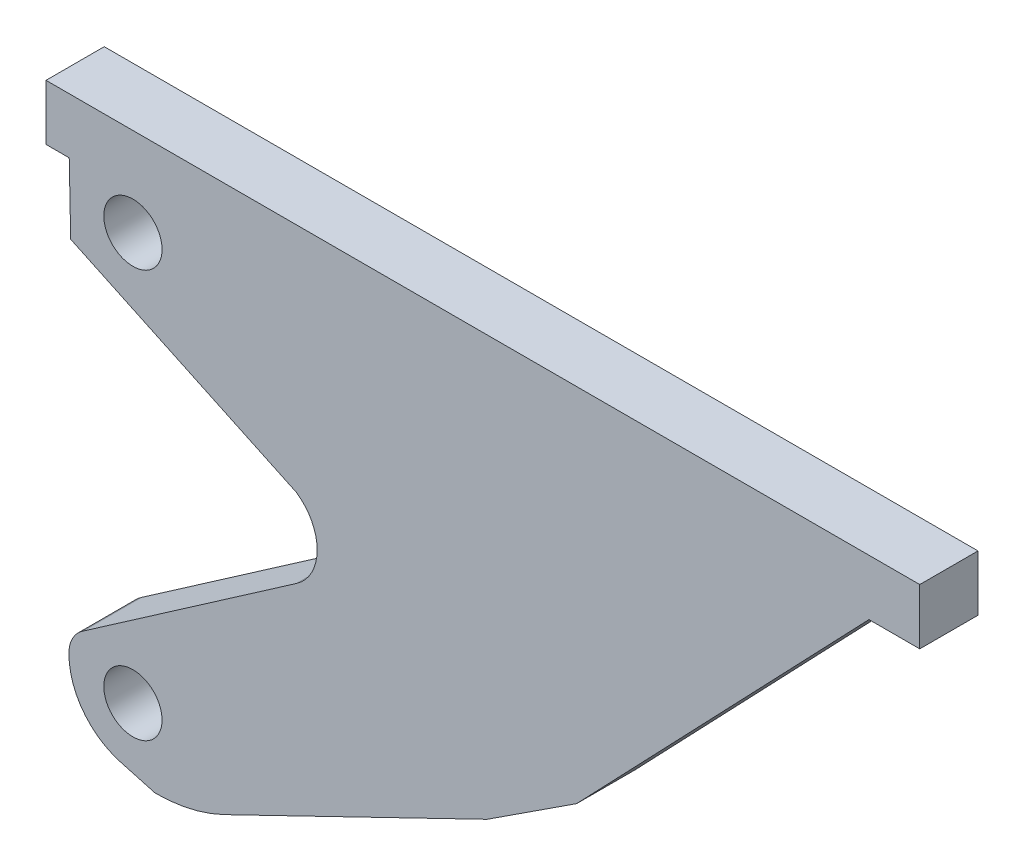
ISO-10303-21;
HEADER;
FILE_DESCRIPTION(('STEP AP214'),'2;1');
FILE_NAME('part.step','',(''),(''),'','','');
FILE_SCHEMA(('AUTOMOTIVE_DESIGN { 1 0 10303 214 1 1 1 1 }'));
ENDSEC;
DATA;
#1=APPLICATION_CONTEXT('core data for automotive mechanical design processes');
#2=APPLICATION_PROTOCOL_DEFINITION('international standard','automotive_design',2000,#1);
#3=PRODUCT_CONTEXT('',#1,'mechanical');
#4=PRODUCT('Part','Part','',(#3));
#5=PRODUCT_RELATED_PRODUCT_CATEGORY('part','',(#4));
#6=PRODUCT_DEFINITION_FORMATION('','',#4);
#7=PRODUCT_DEFINITION_CONTEXT('part definition',#1,'design');
#8=PRODUCT_DEFINITION('design','',#6,#7);
#9=PRODUCT_DEFINITION_SHAPE('','',#8);
#10=(LENGTH_UNIT() NAMED_UNIT(*) SI_UNIT(.MILLI.,.METRE.));
#11=(NAMED_UNIT(*) PLANE_ANGLE_UNIT() SI_UNIT($,.RADIAN.));
#12=(NAMED_UNIT(*) SI_UNIT($,.STERADIAN.) SOLID_ANGLE_UNIT());
#13=UNCERTAINTY_MEASURE_WITH_UNIT(LENGTH_MEASURE(1.E-05),#10,'distance_accuracy_value','');
#14=(GEOMETRIC_REPRESENTATION_CONTEXT(3) GLOBAL_UNCERTAINTY_ASSIGNED_CONTEXT((#13)) GLOBAL_UNIT_ASSIGNED_CONTEXT((#10,
#11,#12)) REPRESENTATION_CONTEXT('',''));
#15=CARTESIAN_POINT('',(0.,0.,0.));
#16=DIRECTION('',(0.,0.,1.));
#17=DIRECTION('',(1.,0.,0.));
#18=AXIS2_PLACEMENT_3D('',#15,#16,#17);
#19=CARTESIAN_POINT('',(18.5660887042144,33.5697337801908,20.));
#20=DIRECTION('',(0.,0.,-1.));
#21=DIRECTION('',(-1.,0.,0.));
#22=AXIS2_PLACEMENT_3D('',#19,#20,#21);
#23=PLANE('',#22);
#24=CARTESIAN_POINT('',(18.5660887042144,33.5697337801908,20.));
#25=DIRECTION('',(0.,0.,1.));
#26=DIRECTION('',(-1.,0.,0.));
#27=AXIS2_PLACEMENT_3D('',#24,#25,#26);
#28=CIRCLE('',#27,10.6872798444424);
#29=CARTESIAN_POINT('',(12.678109290342,42.4887947674943,20.));
#30=VERTEX_POINT('',#29);
#31=CARTESIAN_POINT('',(7.88121750242458,33.7966211412047,20.));
#32=VERTEX_POINT('',#31);
#33=EDGE_CURVE('E242',#30,#32,#28,.T.);
#34=ORIENTED_EDGE('',*,*,#33,.T.);
#35=CARTESIAN_POINT('',(32.0141573052579,33.2841714427511,20.));
#36=DIRECTION('',(0.,0.,1.));
#37=DIRECTION('',(-1.,0.,0.));
#38=AXIS2_PLACEMENT_3D('',#35,#36,#37);
#39=CIRCLE('',#38,24.1383799833506);
#40=CARTESIAN_POINT('',(25.5748035964629,10.0205493680688,20.));
#41=VERTEX_POINT('',#40);
#42=EDGE_CURVE('E129',#32,#41,#39,.T.);
#43=ORIENTED_EDGE('',*,*,#42,.T.);
#44=DIRECTION('',(0.963760703523948,-0.266768263372957,0.));
#45=VECTOR('',#44,1.);
#46=CARTESIAN_POINT('',(37.4689225243492,6.72826587991469,20.));
#47=LINE('',#46,#45);
#48=CARTESIAN_POINT('',(37.4689225243492,6.72826587991469,20.));
#49=VERTEX_POINT('',#48);
#50=EDGE_CURVE('E295',#41,#49,#47,.T.);
#51=ORIENTED_EDGE('',*,*,#50,.T.);
#52=CARTESIAN_POINT('',(37.4689225243491,61.078050884108,20.));
#53=DIRECTION('',(0.,0.,1.));
#54=DIRECTION('',(-1.,0.,0.));
#55=AXIS2_PLACEMENT_3D('',#52,#53,#54);
#56=CIRCLE('',#55,54.3497850041933);
#57=CARTESIAN_POINT('',(61.1680774455038,12.1674264143147,20.));
#58=VERTEX_POINT('',#57);
#59=EDGE_CURVE('E315',#49,#58,#56,.T.);
#60=ORIENTED_EDGE('',*,*,#59,.T.);
#61=DIRECTION('',(0.899923053348227,0.43604873357505,0.));
#62=VECTOR('',#61,1.);
#63=CARTESIAN_POINT('',(151.43934620471,55.9074687148351,20.));
#64=LINE('',#63,#62);
#65=CARTESIAN_POINT('',(151.43934620471,55.9074687148351,20.));
#66=VERTEX_POINT('',#65);
#67=EDGE_CURVE('E311',#58,#66,#64,.T.);
#68=ORIENTED_EDGE('',*,*,#67,.T.);
#69=DIRECTION('',(0.837867904245027,0.545873039301307,0.));
#70=VECTOR('',#69,1.);
#71=CARTESIAN_POINT('',(182.18007939204,75.9351334222431,20.));
#72=LINE('',#71,#70);
#73=CARTESIAN_POINT('',(182.18007939204,75.9351334222431,20.));
#74=VERTEX_POINT('',#73);
#75=EDGE_CURVE('E314',#66,#74,#72,.T.);
#76=ORIENTED_EDGE('',*,*,#75,.T.);
#77=DIRECTION('',(0.691287277727629,0.722580029928813,0.));
#78=VECTOR('',#77,1.);
#79=CARTESIAN_POINT('',(282.564213808547,180.863392899973,20.));
#80=LINE('',#79,#78);
#81=CARTESIAN_POINT('',(282.564213808547,180.863392899973,20.));
#82=VERTEX_POINT('',#81);
#83=EDGE_CURVE('E319',#74,#82,#80,.T.);
#84=ORIENTED_EDGE('',*,*,#83,.T.);
#85=DIRECTION('',(1.,0.,0.));
#86=VECTOR('',#85,1.);
#87=CARTESIAN_POINT('',(300.,180.863392899973,20.));
#88=LINE('',#87,#86);
#89=CARTESIAN_POINT('',(300.,180.863392899973,20.));
#90=VERTEX_POINT('',#89);
#91=EDGE_CURVE('E327',#82,#90,#88,.T.);
#92=ORIENTED_EDGE('',*,*,#91,.T.);
#93=DIRECTION('',(0.,1.,0.));
#94=VECTOR('',#93,1.);
#95=CARTESIAN_POINT('',(300.,200.,20.));
#96=LINE('',#95,#94);
#97=CARTESIAN_POINT('',(300.,200.,20.));
#98=VERTEX_POINT('',#97);
#99=EDGE_CURVE('E330',#90,#98,#96,.T.);
#100=ORIENTED_EDGE('',*,*,#99,.T.);
#101=DIRECTION('',(-0.99999997295116,-0.000232589076362976,0.));
#102=VECTOR('',#101,1.);
#103=CARTESIAN_POINT('',(0.,199.930223275204,20.));
#104=LINE('',#103,#102);
#105=CARTESIAN_POINT('',(0.,199.930223275204,20.));
#106=VERTEX_POINT('',#105);
#107=EDGE_CURVE('E332',#98,#106,#104,.T.);
#108=ORIENTED_EDGE('',*,*,#107,.T.);
#109=DIRECTION('',(0.,-1.,0.));
#110=VECTOR('',#109,1.);
#111=CARTESIAN_POINT('',(0.,180.863392899973,20.));
#112=LINE('',#111,#110);
#113=CARTESIAN_POINT('',(0.,180.863392899973,20.));
#114=VERTEX_POINT('',#113);
#115=EDGE_CURVE('E336',#106,#114,#112,.T.);
#116=ORIENTED_EDGE('',*,*,#115,.T.);
#117=DIRECTION('',(1.,0.,0.));
#118=VECTOR('',#117,1.);
#119=CARTESIAN_POINT('',(7.97663603526422,180.863392899973,20.));
#120=LINE('',#119,#118);
#121=CARTESIAN_POINT('',(7.97663603526422,180.863392899973,20.));
#122=VERTEX_POINT('',#121);
#123=EDGE_CURVE('E339',#114,#122,#120,.T.);
#124=ORIENTED_EDGE('',*,*,#123,.T.);
#125=DIRECTION('',(0.0210436934428124,-0.999778556964633,0.));
#126=VECTOR('',#125,1.);
#127=CARTESIAN_POINT('',(8.48105642891595,156.89855542317,20.));
#128=LINE('',#127,#126);
#129=CARTESIAN_POINT('',(8.48105642891595,156.89855542317,20.));
#130=VERTEX_POINT('',#129);
#131=EDGE_CURVE('E172',#122,#130,#128,.T.);
#132=ORIENTED_EDGE('',*,*,#131,.T.);
#133=DIRECTION('',(0.904610586069068,-0.426239002874887,0.));
#134=VECTOR('',#133,1.);
#135=CARTESIAN_POINT('',(86.0364227386809,120.35562467203,20.));
#136=LINE('',#135,#134);
#137=CARTESIAN_POINT('',(86.0364227386809,120.35562467203,20.));
#138=VERTEX_POINT('',#137);
#139=EDGE_CURVE('E166',#130,#138,#136,.T.);
#140=ORIENTED_EDGE('',*,*,#139,.T.);
#141=CARTESIAN_POINT('',(76.6736149660051,106.849857246686,20.));
#142=DIRECTION('',(0.,0.,-1.));
#143=DIRECTION('',(1.,0.,0.));
#144=AXIS2_PLACEMENT_3D('',#141,#142,#143);
#145=CIRCLE('',#144,16.4337434303797);
#146=CARTESIAN_POINT('',(86.0364227386809,93.3440898213426,20.));
#147=VERTEX_POINT('',#146);
#148=EDGE_CURVE('E170',#138,#147,#145,.T.);
#149=ORIENTED_EDGE('',*,*,#148,.T.);
#150=DIRECTION('',(-0.821831464179762,-0.569730677148553,0.));
#151=VECTOR('',#150,1.);
#152=CARTESIAN_POINT('',(12.678109290342,42.4887947674943,20.));
#153=LINE('',#152,#151);
#154=EDGE_CURVE('E62',#147,#30,#153,.T.);
#155=ORIENTED_EDGE('',*,*,#154,.T.);
#156=EDGE_LOOP('',(#34,#43,#51,#60,#68,#76,#84,#92,#100,#108,#116,#124,#132,#140,#149,#155));
#157=FACE_BOUND('',#156,.T.);
#158=CARTESIAN_POINT('',(29.8456107963056,29.6227737011177,20.));
#159=DIRECTION('',(0.,0.,1.));
#160=DIRECTION('',(1.,0.,0.));
#161=AXIS2_PLACEMENT_3D('',#158,#159,#160);
#162=CIRCLE('',#161,10.);
#163=CARTESIAN_POINT('',(39.8456107963056,29.6227737011177,20.));
#164=VERTEX_POINT('',#163);
#165=EDGE_CURVE('E200',#164,#164,#162,.T.);
#166=ORIENTED_EDGE('',*,*,#165,.F.);
#167=EDGE_LOOP('',(#166));
#168=FACE_BOUND('',#167,.T.);
#169=CARTESIAN_POINT('',(29.8456107963056,169.541616803424,20.));
#170=DIRECTION('',(0.,0.,1.));
#171=DIRECTION('',(1.,0.,0.));
#172=AXIS2_PLACEMENT_3D('',#169,#170,#171);
#173=CIRCLE('',#172,10.);
#174=CARTESIAN_POINT('',(39.8456107963056,169.541616803424,20.));
#175=VERTEX_POINT('',#174);
#176=EDGE_CURVE('E382',#175,#175,#173,.T.);
#177=ORIENTED_EDGE('',*,*,#176,.F.);
#178=EDGE_LOOP('',(#177));
#179=FACE_BOUND('',#178,.T.);
#180=ADVANCED_FACE('F44',(#157,#168,#179),#23,.F.);
#181=CARTESIAN_POINT('',(18.5660887042144,33.5697337801908,0.));
#182=DIRECTION('',(0.,0.,-1.));
#183=DIRECTION('',(-1.,0.,0.));
#184=AXIS2_PLACEMENT_3D('',#181,#182,#183);
#185=PLANE('',#184);
#186=CARTESIAN_POINT('',(29.8456107963056,29.6227737011177,0.));
#187=DIRECTION('',(0.,0.,1.));
#188=DIRECTION('',(1.,0.,0.));
#189=AXIS2_PLACEMENT_3D('',#186,#187,#188);
#190=CIRCLE('',#189,10.);
#191=CARTESIAN_POINT('',(39.8456107963056,29.6227737011177,0.));
#192=VERTEX_POINT('',#191);
#193=EDGE_CURVE('E389',#192,#192,#190,.T.);
#194=ORIENTED_EDGE('',*,*,#193,.T.);
#195=EDGE_LOOP('',(#194));
#196=FACE_BOUND('',#195,.T.);
#197=CARTESIAN_POINT('',(18.5660887042144,33.5697337801908,0.));
#198=DIRECTION('',(0.,0.,1.));
#199=DIRECTION('',(-1.,0.,0.));
#200=AXIS2_PLACEMENT_3D('',#197,#198,#199);
#201=CIRCLE('',#200,10.6872798444424);
#202=CARTESIAN_POINT('',(12.678109290342,42.4887947674943,0.));
#203=VERTEX_POINT('',#202);
#204=CARTESIAN_POINT('',(7.88121750242458,33.7966211412047,0.));
#205=VERTEX_POINT('',#204);
#206=EDGE_CURVE('E195',#203,#205,#201,.T.);
#207=ORIENTED_EDGE('',*,*,#206,.F.);
#208=DIRECTION('',(-0.821831464179762,-0.569730677148553,0.));
#209=VECTOR('',#208,1.);
#210=CARTESIAN_POINT('',(12.678109290342,42.4887947674943,0.));
#211=LINE('',#210,#209);
#212=CARTESIAN_POINT('',(86.0364227386809,93.3440898213426,0.));
#213=VERTEX_POINT('',#212);
#214=EDGE_CURVE('E121',#213,#203,#211,.T.);
#215=ORIENTED_EDGE('',*,*,#214,.F.);
#216=CARTESIAN_POINT('',(76.6736149660051,106.849857246686,0.));
#217=DIRECTION('',(0.,0.,-1.));
#218=DIRECTION('',(1.,0.,0.));
#219=AXIS2_PLACEMENT_3D('',#216,#217,#218);
#220=CIRCLE('',#219,16.4337434303797);
#221=CARTESIAN_POINT('',(86.0364227386809,120.35562467203,0.));
#222=VERTEX_POINT('',#221);
#223=EDGE_CURVE('E115',#222,#213,#220,.T.);
#224=ORIENTED_EDGE('',*,*,#223,.F.);
#225=DIRECTION('',(0.904610586069068,-0.426239002874887,0.));
#226=VECTOR('',#225,1.);
#227=CARTESIAN_POINT('',(86.0364227386809,120.35562467203,0.));
#228=LINE('',#227,#226);
#229=CARTESIAN_POINT('',(8.48105642891595,156.89855542317,0.));
#230=VERTEX_POINT('',#229);
#231=EDGE_CURVE('E181',#230,#222,#228,.T.);
#232=ORIENTED_EDGE('',*,*,#231,.F.);
#233=DIRECTION('',(0.0210436934428124,-0.999778556964633,0.));
#234=VECTOR('',#233,1.);
#235=CARTESIAN_POINT('',(8.48105642891595,156.89855542317,0.));
#236=LINE('',#235,#234);
#237=CARTESIAN_POINT('',(7.97663603526422,180.863392899973,0.));
#238=VERTEX_POINT('',#237);
#239=EDGE_CURVE('E233',#238,#230,#236,.T.);
#240=ORIENTED_EDGE('',*,*,#239,.F.);
#241=DIRECTION('',(1.,0.,0.));
#242=VECTOR('',#241,1.);
#243=CARTESIAN_POINT('',(7.97663603526422,180.863392899973,0.));
#244=LINE('',#243,#242);
#245=CARTESIAN_POINT('',(0.,180.863392899973,0.));
#246=VERTEX_POINT('',#245);
#247=EDGE_CURVE('E230',#246,#238,#244,.T.);
#248=ORIENTED_EDGE('',*,*,#247,.F.);
#249=DIRECTION('',(0.,-1.,0.));
#250=VECTOR('',#249,1.);
#251=CARTESIAN_POINT('',(0.,180.863392899973,0.));
#252=LINE('',#251,#250);
#253=CARTESIAN_POINT('',(0.,199.930223275204,0.));
#254=VERTEX_POINT('',#253);
#255=EDGE_CURVE('E227',#254,#246,#252,.T.);
#256=ORIENTED_EDGE('',*,*,#255,.F.);
#257=DIRECTION('',(-0.99999997295116,-0.000232589076362976,0.));
#258=VECTOR('',#257,1.);
#259=CARTESIAN_POINT('',(0.,199.930223275204,0.));
#260=LINE('',#259,#258);
#261=CARTESIAN_POINT('',(300.,200.,0.));
#262=VERTEX_POINT('',#261);
#263=EDGE_CURVE('E224',#262,#254,#260,.T.);
#264=ORIENTED_EDGE('',*,*,#263,.F.);
#265=DIRECTION('',(0.,1.,0.));
#266=VECTOR('',#265,1.);
#267=CARTESIAN_POINT('',(300.,200.,0.));
#268=LINE('',#267,#266);
#269=CARTESIAN_POINT('',(300.,180.863392899973,0.));
#270=VERTEX_POINT('',#269);
#271=EDGE_CURVE('E221',#270,#262,#268,.T.);
#272=ORIENTED_EDGE('',*,*,#271,.F.);
#273=DIRECTION('',(1.,0.,0.));
#274=VECTOR('',#273,1.);
#275=CARTESIAN_POINT('',(300.,180.863392899973,0.));
#276=LINE('',#275,#274);
#277=CARTESIAN_POINT('',(282.564213808547,180.863392899973,0.));
#278=VERTEX_POINT('',#277);
#279=EDGE_CURVE('E218',#278,#270,#276,.T.);
#280=ORIENTED_EDGE('',*,*,#279,.F.);
#281=DIRECTION('',(0.691287277727629,0.722580029928813,0.));
#282=VECTOR('',#281,1.);
#283=CARTESIAN_POINT('',(282.564213808547,180.863392899973,0.));
#284=LINE('',#283,#282);
#285=CARTESIAN_POINT('',(182.18007939204,75.9351334222431,0.));
#286=VERTEX_POINT('',#285);
#287=EDGE_CURVE('E215',#286,#278,#284,.T.);
#288=ORIENTED_EDGE('',*,*,#287,.F.);
#289=DIRECTION('',(0.837867904245027,0.545873039301307,0.));
#290=VECTOR('',#289,1.);
#291=CARTESIAN_POINT('',(182.18007939204,75.9351334222431,0.));
#292=LINE('',#291,#290);
#293=CARTESIAN_POINT('',(151.43934620471,55.9074687148351,0.));
#294=VERTEX_POINT('',#293);
#295=EDGE_CURVE('E212',#294,#286,#292,.T.);
#296=ORIENTED_EDGE('',*,*,#295,.F.);
#297=DIRECTION('',(0.899923053348227,0.43604873357505,0.));
#298=VECTOR('',#297,1.);
#299=CARTESIAN_POINT('',(151.43934620471,55.9074687148351,0.));
#300=LINE('',#299,#298);
#301=CARTESIAN_POINT('',(61.1680774455038,12.1674264143147,0.));
#302=VERTEX_POINT('',#301);
#303=EDGE_CURVE('E209',#302,#294,#300,.T.);
#304=ORIENTED_EDGE('',*,*,#303,.F.);
#305=CARTESIAN_POINT('',(37.4689225243491,61.078050884108,0.));
#306=DIRECTION('',(0.,0.,1.));
#307=DIRECTION('',(-1.,0.,0.));
#308=AXIS2_PLACEMENT_3D('',#305,#306,#307);
#309=CIRCLE('',#308,54.3497850041933);
#310=CARTESIAN_POINT('',(37.4689225243492,6.72826587991469,0.));
#311=VERTEX_POINT('',#310);
#312=EDGE_CURVE('E206',#311,#302,#309,.T.);
#313=ORIENTED_EDGE('',*,*,#312,.F.);
#314=DIRECTION('',(0.963760703523948,-0.266768263372957,0.));
#315=VECTOR('',#314,1.);
#316=CARTESIAN_POINT('',(37.4689225243492,6.72826587991469,0.));
#317=LINE('',#316,#315);
#318=CARTESIAN_POINT('',(25.5748035964629,10.0205493680688,0.));
#319=VERTEX_POINT('',#318);
#320=EDGE_CURVE('E203',#319,#311,#317,.T.);
#321=ORIENTED_EDGE('',*,*,#320,.F.);
#322=CARTESIAN_POINT('',(32.0141573052579,33.2841714427511,0.));
#323=DIRECTION('',(0.,0.,1.));
#324=DIRECTION('',(-1.,0.,0.));
#325=AXIS2_PLACEMENT_3D('',#322,#323,#324);
#326=CIRCLE('',#325,24.1383799833506);
#327=EDGE_CURVE('E199',#205,#319,#326,.T.);
#328=ORIENTED_EDGE('',*,*,#327,.F.);
#329=EDGE_LOOP('',(#207,#215,#224,#232,#240,#248,#256,#264,#272,#280,#288,#296,#304,#313,#321,#328));
#330=FACE_BOUND('',#329,.T.);
#331=CARTESIAN_POINT('',(29.8456107963056,169.541616803424,0.));
#332=DIRECTION('',(0.,0.,1.));
#333=DIRECTION('',(1.,0.,0.));
#334=AXIS2_PLACEMENT_3D('',#331,#332,#333);
#335=CIRCLE('',#334,10.);
#336=CARTESIAN_POINT('',(39.8456107963056,169.541616803424,0.));
#337=VERTEX_POINT('',#336);
#338=EDGE_CURVE('E385',#337,#337,#335,.T.);
#339=ORIENTED_EDGE('',*,*,#338,.T.);
#340=EDGE_LOOP('',(#339));
#341=FACE_BOUND('',#340,.T.);
#342=ADVANCED_FACE('F299',(#196,#330,#341),#185,.T.);
#343=CARTESIAN_POINT('',(18.5660887042144,33.5697337801908,20.));
#344=DIRECTION('',(0.,0.,-1.));
#345=DIRECTION('',(-1.,0.,0.));
#346=AXIS2_PLACEMENT_3D('',#343,#344,#345);
#347=CYLINDRICAL_SURFACE('',#346,10.6872798444424);
#348=ORIENTED_EDGE('',*,*,#206,.T.);
#349=DIRECTION('',(0.,0.,-1.));
#350=VECTOR('',#349,1.);
#351=CARTESIAN_POINT('',(7.88121750242458,33.7966211412047,20.));
#352=LINE('',#351,#350);
#353=EDGE_CURVE('E12',#32,#205,#352,.T.);
#354=ORIENTED_EDGE('',*,*,#353,.F.);
#355=ORIENTED_EDGE('',*,*,#33,.F.);
#356=DIRECTION('',(0.,0.,-1.));
#357=VECTOR('',#356,1.);
#358=CARTESIAN_POINT('',(12.678109290342,42.4887947674943,20.));
#359=LINE('',#358,#357);
#360=EDGE_CURVE('E190',#30,#203,#359,.T.);
#361=ORIENTED_EDGE('',*,*,#360,.T.);
#362=EDGE_LOOP('',(#348,#354,#355,#361));
#363=FACE_BOUND('',#362,.T.);
#364=ADVANCED_FACE('F46',(#363),#347,.T.);
#365=CARTESIAN_POINT('',(32.0141573052579,33.2841714427511,20.));
#366=DIRECTION('',(0.,0.,-1.));
#367=DIRECTION('',(-1.,0.,0.));
#368=AXIS2_PLACEMENT_3D('',#365,#366,#367);
#369=CYLINDRICAL_SURFACE('',#368,24.1383799833506);
#370=ORIENTED_EDGE('',*,*,#327,.T.);
#371=DIRECTION('',(0.,0.,-1.));
#372=VECTOR('',#371,1.);
#373=CARTESIAN_POINT('',(25.5748035964629,10.0205493680688,20.));
#374=LINE('',#373,#372);
#375=EDGE_CURVE('E54',#41,#319,#374,.T.);
#376=ORIENTED_EDGE('',*,*,#375,.F.);
#377=ORIENTED_EDGE('',*,*,#42,.F.);
#378=ORIENTED_EDGE('',*,*,#353,.T.);
#379=EDGE_LOOP('',(#370,#376,#377,#378));
#380=FACE_BOUND('',#379,.T.);
#381=ADVANCED_FACE('F539',(#380),#369,.T.);
#382=CARTESIAN_POINT('',(37.4689225243492,6.72826587991469,20.));
#383=DIRECTION('',(0.266768263372957,0.963760703523949,0.));
#384=DIRECTION('',(-0.963760703523949,0.266768263372957,0.));
#385=AXIS2_PLACEMENT_3D('',#382,#383,#384);
#386=PLANE('',#385);
#387=ORIENTED_EDGE('',*,*,#320,.T.);
#388=DIRECTION('',(0.,0.,-1.));
#389=VECTOR('',#388,1.);
#390=CARTESIAN_POINT('',(37.4689225243492,6.72826587991469,20.));
#391=LINE('',#390,#389);
#392=EDGE_CURVE('E285',#49,#311,#391,.T.);
#393=ORIENTED_EDGE('',*,*,#392,.F.);
#394=ORIENTED_EDGE('',*,*,#50,.F.);
#395=ORIENTED_EDGE('',*,*,#375,.T.);
#396=EDGE_LOOP('',(#387,#393,#394,#395));
#397=FACE_BOUND('',#396,.T.);
#398=ADVANCED_FACE('F293',(#397),#386,.F.);
#399=CARTESIAN_POINT('',(37.4689225243491,61.078050884108,20.));
#400=DIRECTION('',(0.,0.,-1.));
#401=DIRECTION('',(-1.,0.,0.));
#402=AXIS2_PLACEMENT_3D('',#399,#400,#401);
#403=CYLINDRICAL_SURFACE('',#402,54.3497850041933);
#404=ORIENTED_EDGE('',*,*,#312,.T.);
#405=DIRECTION('',(0.,0.,-1.));
#406=VECTOR('',#405,1.);
#407=CARTESIAN_POINT('',(61.1680774455038,12.1674264143147,20.));
#408=LINE('',#407,#406);
#409=EDGE_CURVE('E281',#58,#302,#408,.T.);
#410=ORIENTED_EDGE('',*,*,#409,.F.);
#411=ORIENTED_EDGE('',*,*,#59,.F.);
#412=ORIENTED_EDGE('',*,*,#392,.T.);
#413=EDGE_LOOP('',(#404,#410,#411,#412));
#414=FACE_BOUND('',#413,.T.);
#415=ADVANCED_FACE('F305',(#414),#403,.T.);
#416=CARTESIAN_POINT('',(151.43934620471,55.9074687148351,20.));
#417=DIRECTION('',(-0.43604873357505,0.899923053348227,0.));
#418=DIRECTION('',(-0.899923053348227,-0.43604873357505,0.));
#419=AXIS2_PLACEMENT_3D('',#416,#417,#418);
#420=PLANE('',#419);
#421=ORIENTED_EDGE('',*,*,#303,.T.);
#422=DIRECTION('',(0.,0.,-1.));
#423=VECTOR('',#422,1.);
#424=CARTESIAN_POINT('',(151.43934620471,55.9074687148351,20.));
#425=LINE('',#424,#423);
#426=EDGE_CURVE('E277',#66,#294,#425,.T.);
#427=ORIENTED_EDGE('',*,*,#426,.F.);
#428=ORIENTED_EDGE('',*,*,#67,.F.);
#429=ORIENTED_EDGE('',*,*,#409,.T.);
#430=EDGE_LOOP('',(#421,#427,#428,#429));
#431=FACE_BOUND('',#430,.T.);
#432=ADVANCED_FACE('F309',(#431),#420,.F.);
#433=CARTESIAN_POINT('',(182.18007939204,75.9351334222431,20.));
#434=DIRECTION('',(-0.545873039301307,0.837867904245027,0.));
#435=DIRECTION('',(-0.837867904245027,-0.545873039301307,0.));
#436=AXIS2_PLACEMENT_3D('',#433,#434,#435);
#437=PLANE('',#436);
#438=ORIENTED_EDGE('',*,*,#295,.T.);
#439=DIRECTION('',(0.,0.,-1.));
#440=VECTOR('',#439,1.);
#441=CARTESIAN_POINT('',(182.18007939204,75.9351334222431,20.));
#442=LINE('',#441,#440);
#443=EDGE_CURVE('E273',#74,#286,#442,.T.);
#444=ORIENTED_EDGE('',*,*,#443,.F.);
#445=ORIENTED_EDGE('',*,*,#75,.F.);
#446=ORIENTED_EDGE('',*,*,#426,.T.);
#447=EDGE_LOOP('',(#438,#444,#445,#446));
#448=FACE_BOUND('',#447,.T.);
#449=ADVANCED_FACE('F508',(#448),#437,.F.);
#450=CARTESIAN_POINT('',(282.564213808547,180.863392899973,20.));
#451=DIRECTION('',(-0.722580029928813,0.691287277727629,0.));
#452=DIRECTION('',(-0.691287277727629,-0.722580029928813,0.));
#453=AXIS2_PLACEMENT_3D('',#450,#451,#452);
#454=PLANE('',#453);
#455=ORIENTED_EDGE('',*,*,#287,.T.);
#456=DIRECTION('',(0.,0.,-1.));
#457=VECTOR('',#456,1.);
#458=CARTESIAN_POINT('',(282.564213808547,180.863392899973,20.));
#459=LINE('',#458,#457);
#460=EDGE_CURVE('E269',#82,#278,#459,.T.);
#461=ORIENTED_EDGE('',*,*,#460,.F.);
#462=ORIENTED_EDGE('',*,*,#83,.F.);
#463=ORIENTED_EDGE('',*,*,#443,.T.);
#464=EDGE_LOOP('',(#455,#461,#462,#463));
#465=FACE_BOUND('',#464,.T.);
#466=ADVANCED_FACE('F499',(#465),#454,.F.);
#467=CARTESIAN_POINT('',(300.,180.863392899973,20.));
#468=DIRECTION('',(0.,1.,0.));
#469=DIRECTION('',(0.,0.,1.));
#470=AXIS2_PLACEMENT_3D('',#467,#468,#469);
#471=PLANE('',#470);
#472=ORIENTED_EDGE('',*,*,#279,.T.);
#473=DIRECTION('',(0.,0.,-1.));
#474=VECTOR('',#473,1.);
#475=CARTESIAN_POINT('',(300.,180.863392899973,20.));
#476=LINE('',#475,#474);
#477=EDGE_CURVE('E265',#90,#270,#476,.T.);
#478=ORIENTED_EDGE('',*,*,#477,.F.);
#479=ORIENTED_EDGE('',*,*,#91,.F.);
#480=ORIENTED_EDGE('',*,*,#460,.T.);
#481=EDGE_LOOP('',(#472,#478,#479,#480));
#482=FACE_BOUND('',#481,.T.);
#483=ADVANCED_FACE('F491',(#482),#471,.F.);
#484=CARTESIAN_POINT('',(300.,200.,20.));
#485=DIRECTION('',(-1.,0.,0.));
#486=DIRECTION('',(0.,0.,1.));
#487=AXIS2_PLACEMENT_3D('',#484,#485,#486);
#488=PLANE('',#487);
#489=ORIENTED_EDGE('',*,*,#271,.T.);
#490=DIRECTION('',(0.,0.,-1.));
#491=VECTOR('',#490,1.);
#492=CARTESIAN_POINT('',(300.,200.,20.));
#493=LINE('',#492,#491);
#494=EDGE_CURVE('E261',#98,#262,#493,.T.);
#495=ORIENTED_EDGE('',*,*,#494,.F.);
#496=ORIENTED_EDGE('',*,*,#99,.F.);
#497=ORIENTED_EDGE('',*,*,#477,.T.);
#498=EDGE_LOOP('',(#489,#495,#496,#497));
#499=FACE_BOUND('',#498,.T.);
#500=ADVANCED_FACE('F426',(#499),#488,.F.);
#501=CARTESIAN_POINT('',(0.,199.930223275204,20.));
#502=DIRECTION('',(0.000232589076362976,-0.99999997295116,0.));
#503=DIRECTION('',(0.99999997295116,0.000232589076362976,0.));
#504=AXIS2_PLACEMENT_3D('',#501,#502,#503);
#505=PLANE('',#504);
#506=ORIENTED_EDGE('',*,*,#263,.T.);
#507=DIRECTION('',(0.,0.,-1.));
#508=VECTOR('',#507,1.);
#509=CARTESIAN_POINT('',(0.,199.930223275204,20.));
#510=LINE('',#509,#508);
#511=EDGE_CURVE('E257',#106,#254,#510,.T.);
#512=ORIENTED_EDGE('',*,*,#511,.F.);
#513=ORIENTED_EDGE('',*,*,#107,.F.);
#514=ORIENTED_EDGE('',*,*,#494,.T.);
#515=EDGE_LOOP('',(#506,#512,#513,#514));
#516=FACE_BOUND('',#515,.T.);
#517=ADVANCED_FACE('F422',(#516),#505,.F.);
#518=CARTESIAN_POINT('',(0.,180.863392899973,20.));
#519=DIRECTION('',(1.,0.,0.));
#520=DIRECTION('',(0.,0.,-1.));
#521=AXIS2_PLACEMENT_3D('',#518,#519,#520);
#522=PLANE('',#521);
#523=ORIENTED_EDGE('',*,*,#255,.T.);
#524=DIRECTION('',(0.,0.,-1.));
#525=VECTOR('',#524,1.);
#526=CARTESIAN_POINT('',(0.,180.863392899973,20.));
#527=LINE('',#526,#525);
#528=EDGE_CURVE('E253',#114,#246,#527,.T.);
#529=ORIENTED_EDGE('',*,*,#528,.F.);
#530=ORIENTED_EDGE('',*,*,#115,.F.);
#531=ORIENTED_EDGE('',*,*,#511,.T.);
#532=EDGE_LOOP('',(#523,#529,#530,#531));
#533=FACE_BOUND('',#532,.T.);
#534=ADVANCED_FACE('F425',(#533),#522,.F.);
#535=CARTESIAN_POINT('',(7.97663603526422,180.863392899973,20.));
#536=DIRECTION('',(0.,1.,0.));
#537=DIRECTION('',(0.,0.,1.));
#538=AXIS2_PLACEMENT_3D('',#535,#536,#537);
#539=PLANE('',#538);
#540=ORIENTED_EDGE('',*,*,#247,.T.);
#541=DIRECTION('',(0.,0.,-1.));
#542=VECTOR('',#541,1.);
#543=CARTESIAN_POINT('',(7.97663603526422,180.863392899973,20.));
#544=LINE('',#543,#542);
#545=EDGE_CURVE('E249',#122,#238,#544,.T.);
#546=ORIENTED_EDGE('',*,*,#545,.F.);
#547=ORIENTED_EDGE('',*,*,#123,.F.);
#548=ORIENTED_EDGE('',*,*,#528,.T.);
#549=EDGE_LOOP('',(#540,#546,#547,#548));
#550=FACE_BOUND('',#549,.T.);
#551=ADVANCED_FACE('F347',(#550),#539,.F.);
#552=CARTESIAN_POINT('',(8.48105642891595,156.89855542317,20.));
#553=DIRECTION('',(0.999778556964634,0.0210436934428124,0.));
#554=DIRECTION('',(-0.0210436934428124,0.999778556964634,0.));
#555=AXIS2_PLACEMENT_3D('',#552,#553,#554);
#556=PLANE('',#555);
#557=ORIENTED_EDGE('',*,*,#239,.T.);
#558=DIRECTION('',(0.,0.,-1.));
#559=VECTOR('',#558,1.);
#560=CARTESIAN_POINT('',(8.48105642891595,156.89855542317,20.));
#561=LINE('',#560,#559);
#562=EDGE_CURVE('E183',#130,#230,#561,.T.);
#563=ORIENTED_EDGE('',*,*,#562,.F.);
#564=ORIENTED_EDGE('',*,*,#131,.F.);
#565=ORIENTED_EDGE('',*,*,#545,.T.);
#566=EDGE_LOOP('',(#557,#563,#564,#565));
#567=FACE_BOUND('',#566,.T.);
#568=ADVANCED_FACE('F351',(#567),#556,.F.);
#569=CARTESIAN_POINT('',(86.0364227386809,120.35562467203,20.));
#570=DIRECTION('',(0.426239002874887,0.904610586069068,0.));
#571=DIRECTION('',(-0.904610586069068,0.426239002874887,0.));
#572=AXIS2_PLACEMENT_3D('',#569,#570,#571);
#573=PLANE('',#572);
#574=ORIENTED_EDGE('',*,*,#231,.T.);
#575=DIRECTION('',(0.,0.,-1.));
#576=VECTOR('',#575,1.);
#577=CARTESIAN_POINT('',(86.0364227386809,120.35562467203,20.));
#578=LINE('',#577,#576);
#579=EDGE_CURVE('E178',#138,#222,#578,.T.);
#580=ORIENTED_EDGE('',*,*,#579,.F.);
#581=ORIENTED_EDGE('',*,*,#139,.F.);
#582=ORIENTED_EDGE('',*,*,#562,.T.);
#583=EDGE_LOOP('',(#574,#580,#581,#582));
#584=FACE_BOUND('',#583,.T.);
#585=ADVANCED_FACE('F179',(#584),#573,.F.);
#586=CARTESIAN_POINT('',(76.6736149660051,106.849857246686,20.));
#587=DIRECTION('',(0.,0.,-1.));
#588=DIRECTION('',(-1.,0.,0.));
#589=AXIS2_PLACEMENT_3D('',#586,#587,#588);
#590=CYLINDRICAL_SURFACE('',#589,16.4337434303797);
#591=ORIENTED_EDGE('',*,*,#223,.T.);
#592=DIRECTION('',(0.,0.,-1.));
#593=VECTOR('',#592,1.);
#594=CARTESIAN_POINT('',(86.0364227386809,93.3440898213426,20.));
#595=LINE('',#594,#593);
#596=EDGE_CURVE('E184',#147,#213,#595,.T.);
#597=ORIENTED_EDGE('',*,*,#596,.F.);
#598=ORIENTED_EDGE('',*,*,#148,.F.);
#599=ORIENTED_EDGE('',*,*,#579,.T.);
#600=EDGE_LOOP('',(#591,#597,#598,#599));
#601=FACE_BOUND('',#600,.T.);
#602=ADVANCED_FACE('F186',(#601),#590,.F.);
#603=CARTESIAN_POINT('',(12.678109290342,42.4887947674943,20.));
#604=DIRECTION('',(0.569730677148553,-0.821831464179762,0.));
#605=DIRECTION('',(0.821831464179762,0.569730677148553,0.));
#606=AXIS2_PLACEMENT_3D('',#603,#604,#605);
#607=PLANE('',#606);
#608=ORIENTED_EDGE('',*,*,#214,.T.);
#609=ORIENTED_EDGE('',*,*,#360,.F.);
#610=ORIENTED_EDGE('',*,*,#154,.F.);
#611=ORIENTED_EDGE('',*,*,#596,.T.);
#612=EDGE_LOOP('',(#608,#609,#610,#611));
#613=FACE_BOUND('',#612,.T.);
#614=ADVANCED_FACE('F355',(#613),#607,.F.);
#615=CARTESIAN_POINT('',(29.8456107963056,29.6227737011177,20.));
#616=DIRECTION('',(0.,0.,-1.));
#617=DIRECTION('',(-1.,0.,0.));
#618=AXIS2_PLACEMENT_3D('',#615,#616,#617);
#619=CYLINDRICAL_SURFACE('',#618,10.);
#620=ORIENTED_EDGE('',*,*,#165,.T.);
#621=EDGE_LOOP('',(#620));
#622=FACE_BOUND('',#621,.T.);
#623=ORIENTED_EDGE('',*,*,#193,.F.);
#624=EDGE_LOOP('',(#623));
#625=FACE_BOUND('',#624,.T.);
#626=ADVANCED_FACE('F357',(#622,#625),#619,.F.);
#627=CARTESIAN_POINT('',(29.8456107963056,169.541616803424,20.));
#628=DIRECTION('',(0.,0.,-1.));
#629=DIRECTION('',(-1.,0.,0.));
#630=AXIS2_PLACEMENT_3D('',#627,#628,#629);
#631=CYLINDRICAL_SURFACE('',#630,10.);
#632=ORIENTED_EDGE('',*,*,#176,.T.);
#633=EDGE_LOOP('',(#632));
#634=FACE_BOUND('',#633,.T.);
#635=ORIENTED_EDGE('',*,*,#338,.F.);
#636=EDGE_LOOP('',(#635));
#637=FACE_BOUND('',#636,.T.);
#638=ADVANCED_FACE('F363',(#634,#637),#631,.F.);
#639=CLOSED_SHELL('',(#180,#342,#364,#381,#398,#415,#432,#449,#466,#483,#500,#517,#534,#551,
#568,#585,#602,#614,#626,#638));
#640=MANIFOLD_SOLID_BREP('B2',#639);
#641=ADVANCED_BREP_SHAPE_REPRESENTATION('',(#18,#640),#14);
#642=SHAPE_DEFINITION_REPRESENTATION(#9,#641);
ENDSEC;
END-ISO-10303-21;
